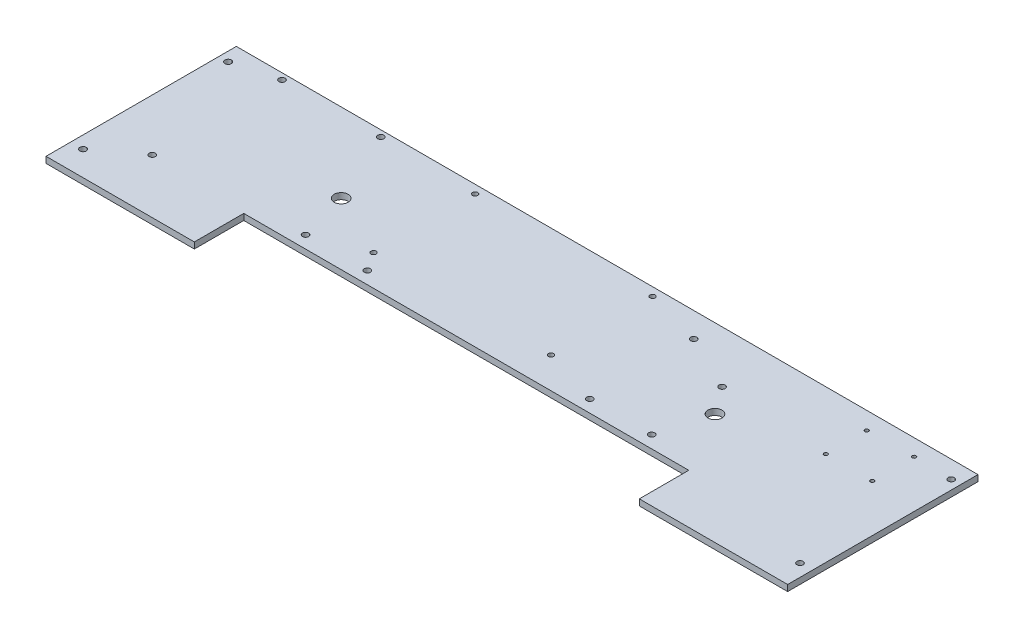
ISO-10303-21;
HEADER;
FILE_DESCRIPTION(('STEP AP214'),'2;1');
FILE_NAME('part.step','',(''),(''),'','','');
FILE_SCHEMA(('AUTOMOTIVE_DESIGN { 1 0 10303 214 1 1 1 1 }'));
ENDSEC;
DATA;
#1=APPLICATION_CONTEXT('core data for automotive mechanical design processes');
#2=APPLICATION_PROTOCOL_DEFINITION('international standard','automotive_design',2000,#1);
#3=PRODUCT_CONTEXT('',#1,'mechanical');
#4=PRODUCT('Part','Part','',(#3));
#5=PRODUCT_RELATED_PRODUCT_CATEGORY('part','',(#4));
#6=PRODUCT_DEFINITION_FORMATION('','',#4);
#7=PRODUCT_DEFINITION_CONTEXT('part definition',#1,'design');
#8=PRODUCT_DEFINITION('design','',#6,#7);
#9=PRODUCT_DEFINITION_SHAPE('','',#8);
#10=(LENGTH_UNIT() NAMED_UNIT(*) SI_UNIT(.MILLI.,.METRE.));
#11=(NAMED_UNIT(*) PLANE_ANGLE_UNIT() SI_UNIT($,.RADIAN.));
#12=(NAMED_UNIT(*) SI_UNIT($,.STERADIAN.) SOLID_ANGLE_UNIT());
#13=UNCERTAINTY_MEASURE_WITH_UNIT(LENGTH_MEASURE(1.E-05),#10,'distance_accuracy_value','');
#14=(GEOMETRIC_REPRESENTATION_CONTEXT(3) GLOBAL_UNCERTAINTY_ASSIGNED_CONTEXT((#13)) GLOBAL_UNIT_ASSIGNED_CONTEXT((#10,
#11,#12)) REPRESENTATION_CONTEXT('',''));
#15=CARTESIAN_POINT('',(0.,0.,0.));
#16=DIRECTION('',(0.,0.,1.));
#17=DIRECTION('',(1.,0.,0.));
#18=AXIS2_PLACEMENT_3D('',#15,#16,#17);
#19=CARTESIAN_POINT('',(609.6,6.35,50.8000000000004));
#20=DIRECTION('',(-1.,0.,0.));
#21=DIRECTION('',(0.,0.,1.));
#22=AXIS2_PLACEMENT_3D('',#19,#20,#21);
#23=PLANE('',#22);
#24=DIRECTION('',(0.,0.,-1.));
#25=VECTOR('',#24,1.);
#26=CARTESIAN_POINT('',(609.6,0.,50.8000000000004));
#27=LINE('',#26,#25);
#28=CARTESIAN_POINT('',(609.6,0.,50.8000000000004));
#29=VERTEX_POINT('',#28);
#30=CARTESIAN_POINT('',(609.6,0.,-144.78));
#31=VERTEX_POINT('',#30);
#32=EDGE_CURVE('E142',#29,#31,#27,.T.);
#33=ORIENTED_EDGE('',*,*,#32,.T.);
#34=DIRECTION('',(0.,-1.,0.));
#35=VECTOR('',#34,1.);
#36=CARTESIAN_POINT('',(609.6,6.35,-144.78));
#37=LINE('',#36,#35);
#38=CARTESIAN_POINT('',(609.6,6.35,-144.78));
#39=VERTEX_POINT('',#38);
#40=EDGE_CURVE('E12',#39,#31,#37,.T.);
#41=ORIENTED_EDGE('',*,*,#40,.F.);
#42=DIRECTION('',(0.,0.,-1.));
#43=VECTOR('',#42,1.);
#44=CARTESIAN_POINT('',(609.6,6.35,50.8000000000004));
#45=LINE('',#44,#43);
#46=CARTESIAN_POINT('',(609.6,6.35,50.8000000000004));
#47=VERTEX_POINT('',#46);
#48=EDGE_CURVE('E169',#47,#39,#45,.T.);
#49=ORIENTED_EDGE('',*,*,#48,.F.);
#50=DIRECTION('',(0.,-1.,0.));
#51=VECTOR('',#50,1.);
#52=CARTESIAN_POINT('',(609.6,6.35,50.8000000000004));
#53=LINE('',#52,#51);
#54=EDGE_CURVE('E138',#47,#29,#53,.T.);
#55=ORIENTED_EDGE('',*,*,#54,.T.);
#56=EDGE_LOOP('',(#33,#41,#49,#55));
#57=FACE_BOUND('',#56,.T.);
#58=ADVANCED_FACE('F39',(#57),#23,.F.);
#59=CARTESIAN_POINT('',(609.6,6.35,-144.78));
#60=DIRECTION('',(0.,0.,1.));
#61=DIRECTION('',(1.,0.,0.));
#62=AXIS2_PLACEMENT_3D('',#59,#60,#61);
#63=PLANE('',#62);
#64=DIRECTION('',(-1.,0.,0.));
#65=VECTOR('',#64,1.);
#66=CARTESIAN_POINT('',(609.6,0.,-144.78));
#67=LINE('',#66,#65);
#68=CARTESIAN_POINT('',(-152.4,0.,-144.78));
#69=VERTEX_POINT('',#68);
#70=EDGE_CURVE('E146',#31,#69,#67,.T.);
#71=ORIENTED_EDGE('',*,*,#70,.T.);
#72=DIRECTION('',(0.,-1.,0.));
#73=VECTOR('',#72,1.);
#74=CARTESIAN_POINT('',(-152.4,6.35,-144.78));
#75=LINE('',#74,#73);
#76=CARTESIAN_POINT('',(-152.4,6.35,-144.78));
#77=VERTEX_POINT('',#76);
#78=EDGE_CURVE('E49',#77,#69,#75,.T.);
#79=ORIENTED_EDGE('',*,*,#78,.F.);
#80=DIRECTION('',(-1.,0.,0.));
#81=VECTOR('',#80,1.);
#82=CARTESIAN_POINT('',(609.6,6.35,-144.78));
#83=LINE('',#82,#81);
#84=EDGE_CURVE('E101',#39,#77,#83,.T.);
#85=ORIENTED_EDGE('',*,*,#84,.F.);
#86=ORIENTED_EDGE('',*,*,#40,.T.);
#87=EDGE_LOOP('',(#71,#79,#85,#86));
#88=FACE_BOUND('',#87,.T.);
#89=ADVANCED_FACE('F397',(#88),#63,.F.);
#90=CARTESIAN_POINT('',(-152.4,6.35,50.7999999999999));
#91=DIRECTION('',(-1.,0.,0.));
#92=DIRECTION('',(0.,0.,1.));
#93=AXIS2_PLACEMENT_3D('',#90,#91,#92);
#94=PLANE('',#93);
#95=DIRECTION('',(0.,0.,-1.));
#96=VECTOR('',#95,1.);
#97=CARTESIAN_POINT('',(-152.4,0.,50.7999999999999));
#98=LINE('',#97,#96);
#99=CARTESIAN_POINT('',(-152.4,0.,50.7999999999999));
#100=VERTEX_POINT('',#99);
#101=EDGE_CURVE('E151',#100,#69,#98,.T.);
#102=ORIENTED_EDGE('',*,*,#101,.F.);
#103=DIRECTION('',(0.,-1.,0.));
#104=VECTOR('',#103,1.);
#105=CARTESIAN_POINT('',(-152.4,6.35,50.7999999999999));
#106=LINE('',#105,#104);
#107=CARTESIAN_POINT('',(-152.4,6.35,50.7999999999999));
#108=VERTEX_POINT('',#107);
#109=EDGE_CURVE('E179',#108,#100,#106,.T.);
#110=ORIENTED_EDGE('',*,*,#109,.F.);
#111=DIRECTION('',(0.,0.,-1.));
#112=VECTOR('',#111,1.);
#113=CARTESIAN_POINT('',(-152.4,6.35,50.7999999999999));
#114=LINE('',#113,#112);
#115=EDGE_CURVE('E367',#108,#77,#114,.T.);
#116=ORIENTED_EDGE('',*,*,#115,.T.);
#117=ORIENTED_EDGE('',*,*,#78,.T.);
#118=EDGE_LOOP('',(#102,#110,#116,#117));
#119=FACE_BOUND('',#118,.T.);
#120=ADVANCED_FACE('F401',(#119),#94,.T.);
#121=CARTESIAN_POINT('',(0.,6.35,50.8));
#122=DIRECTION('',(0.,0.,1.));
#123=DIRECTION('',(1.,0.,0.));
#124=AXIS2_PLACEMENT_3D('',#121,#122,#123);
#125=PLANE('',#124);
#126=DIRECTION('',(-1.,0.,0.));
#127=VECTOR('',#126,1.);
#128=CARTESIAN_POINT('',(0.,0.,50.8));
#129=LINE('',#128,#127);
#130=CARTESIAN_POINT('',(0.,0.,50.8));
#131=VERTEX_POINT('',#130);
#132=EDGE_CURVE('E155',#131,#100,#129,.T.);
#133=ORIENTED_EDGE('',*,*,#132,.F.);
#134=DIRECTION('',(0.,-1.,0.));
#135=VECTOR('',#134,1.);
#136=CARTESIAN_POINT('',(0.,6.35,50.8));
#137=LINE('',#136,#135);
#138=CARTESIAN_POINT('',(0.,6.35,50.8));
#139=VERTEX_POINT('',#138);
#140=EDGE_CURVE('E176',#139,#131,#137,.T.);
#141=ORIENTED_EDGE('',*,*,#140,.F.);
#142=DIRECTION('',(-1.,0.,0.));
#143=VECTOR('',#142,1.);
#144=CARTESIAN_POINT('',(0.,6.35,50.8));
#145=LINE('',#144,#143);
#146=EDGE_CURVE('E371',#139,#108,#145,.T.);
#147=ORIENTED_EDGE('',*,*,#146,.T.);
#148=ORIENTED_EDGE('',*,*,#109,.T.);
#149=EDGE_LOOP('',(#133,#141,#147,#148));
#150=FACE_BOUND('',#149,.T.);
#151=ADVANCED_FACE('F405',(#150),#125,.T.);
#152=CARTESIAN_POINT('',(0.,6.35,0.));
#153=DIRECTION('',(1.,0.,0.));
#154=DIRECTION('',(0.,0.,-1.));
#155=AXIS2_PLACEMENT_3D('',#152,#153,#154);
#156=PLANE('',#155);
#157=DIRECTION('',(0.,0.,1.));
#158=VECTOR('',#157,1.);
#159=CARTESIAN_POINT('',(0.,0.,0.));
#160=LINE('',#159,#158);
#161=CARTESIAN_POINT('',(0.,0.,0.));
#162=VERTEX_POINT('',#161);
#163=EDGE_CURVE('E159',#162,#131,#160,.T.);
#164=ORIENTED_EDGE('',*,*,#163,.F.);
#165=DIRECTION('',(0.,-1.,0.));
#166=VECTOR('',#165,1.);
#167=CARTESIAN_POINT('',(0.,6.35,0.));
#168=LINE('',#167,#166);
#169=CARTESIAN_POINT('',(0.,6.35,0.));
#170=VERTEX_POINT('',#169);
#171=EDGE_CURVE('E131',#170,#162,#168,.T.);
#172=ORIENTED_EDGE('',*,*,#171,.F.);
#173=DIRECTION('',(0.,0.,1.));
#174=VECTOR('',#173,1.);
#175=CARTESIAN_POINT('',(0.,6.35,0.));
#176=LINE('',#175,#174);
#177=EDGE_CURVE('E122',#170,#139,#176,.T.);
#178=ORIENTED_EDGE('',*,*,#177,.T.);
#179=ORIENTED_EDGE('',*,*,#140,.T.);
#180=EDGE_LOOP('',(#164,#172,#178,#179));
#181=FACE_BOUND('',#180,.T.);
#182=ADVANCED_FACE('F377',(#181),#156,.T.);
#183=CARTESIAN_POINT('',(0.,6.35,0.));
#184=DIRECTION('',(0.,0.,-1.));
#185=DIRECTION('',(-1.,0.,0.));
#186=AXIS2_PLACEMENT_3D('',#183,#184,#185);
#187=PLANE('',#186);
#188=DIRECTION('',(1.,0.,0.));
#189=VECTOR('',#188,1.);
#190=CARTESIAN_POINT('',(0.,0.,0.));
#191=LINE('',#190,#189);
#192=CARTESIAN_POINT('',(457.2,0.,1.2490009027033E-13));
#193=VERTEX_POINT('',#192);
#194=EDGE_CURVE('E129',#162,#193,#191,.T.);
#195=ORIENTED_EDGE('',*,*,#194,.T.);
#196=DIRECTION('',(0.,-1.,0.));
#197=VECTOR('',#196,1.);
#198=CARTESIAN_POINT('',(457.2,6.35,1.2490009027033E-13));
#199=LINE('',#198,#197);
#200=CARTESIAN_POINT('',(457.2,6.35,1.2490009027033E-13));
#201=VERTEX_POINT('',#200);
#202=EDGE_CURVE('E126',#201,#193,#199,.T.);
#203=ORIENTED_EDGE('',*,*,#202,.F.);
#204=DIRECTION('',(1.,0.,0.));
#205=VECTOR('',#204,1.);
#206=CARTESIAN_POINT('',(0.,6.35,0.));
#207=LINE('',#206,#205);
#208=EDGE_CURVE('E115',#170,#201,#207,.T.);
#209=ORIENTED_EDGE('',*,*,#208,.F.);
#210=ORIENTED_EDGE('',*,*,#171,.T.);
#211=EDGE_LOOP('',(#195,#203,#209,#210));
#212=FACE_BOUND('',#211,.T.);
#213=ADVANCED_FACE('F127',(#212),#187,.F.);
#214=CARTESIAN_POINT('',(457.2,6.35,1.2490009027033E-13));
#215=DIRECTION('',(1.,0.,0.));
#216=DIRECTION('',(0.,0.,-1.));
#217=AXIS2_PLACEMENT_3D('',#214,#215,#216);
#218=PLANE('',#217);
#219=DIRECTION('',(0.,0.,1.));
#220=VECTOR('',#219,1.);
#221=CARTESIAN_POINT('',(457.2,0.,1.2490009027033E-13));
#222=LINE('',#221,#220);
#223=CARTESIAN_POINT('',(457.2,0.,50.8000000000003));
#224=VERTEX_POINT('',#223);
#225=EDGE_CURVE('E87',#193,#224,#222,.T.);
#226=ORIENTED_EDGE('',*,*,#225,.T.);
#227=DIRECTION('',(0.,-1.,0.));
#228=VECTOR('',#227,1.);
#229=CARTESIAN_POINT('',(457.2,6.35,50.8000000000003));
#230=LINE('',#229,#228);
#231=CARTESIAN_POINT('',(457.2,6.35,50.8000000000003));
#232=VERTEX_POINT('',#231);
#233=EDGE_CURVE('E132',#232,#224,#230,.T.);
#234=ORIENTED_EDGE('',*,*,#233,.F.);
#235=DIRECTION('',(0.,0.,1.));
#236=VECTOR('',#235,1.);
#237=CARTESIAN_POINT('',(457.2,6.35,1.2490009027033E-13));
#238=LINE('',#237,#236);
#239=EDGE_CURVE('E119',#201,#232,#238,.T.);
#240=ORIENTED_EDGE('',*,*,#239,.F.);
#241=ORIENTED_EDGE('',*,*,#202,.T.);
#242=EDGE_LOOP('',(#226,#234,#240,#241));
#243=FACE_BOUND('',#242,.T.);
#244=ADVANCED_FACE('F134',(#243),#218,.F.);
#245=CARTESIAN_POINT('',(457.2,6.35,50.8000000000003));
#246=DIRECTION('',(0.,0.,-1.));
#247=DIRECTION('',(-1.,0.,0.));
#248=AXIS2_PLACEMENT_3D('',#245,#246,#247);
#249=PLANE('',#248);
#250=DIRECTION('',(1.,0.,0.));
#251=VECTOR('',#250,1.);
#252=CARTESIAN_POINT('',(457.2,0.,50.8000000000003));
#253=LINE('',#252,#251);
#254=EDGE_CURVE('E93',#224,#29,#253,.T.);
#255=ORIENTED_EDGE('',*,*,#254,.T.);
#256=ORIENTED_EDGE('',*,*,#54,.F.);
#257=DIRECTION('',(1.,0.,0.));
#258=VECTOR('',#257,1.);
#259=CARTESIAN_POINT('',(457.2,6.35,50.8000000000003));
#260=LINE('',#259,#258);
#261=EDGE_CURVE('E58',#232,#47,#260,.T.);
#262=ORIENTED_EDGE('',*,*,#261,.F.);
#263=ORIENTED_EDGE('',*,*,#233,.T.);
#264=EDGE_LOOP('',(#255,#256,#262,#263));
#265=FACE_BOUND('',#264,.T.);
#266=ADVANCED_FACE('F385',(#265),#249,.F.);
#267=CARTESIAN_POINT('',(0.,6.35,0.));
#268=DIRECTION('',(0.,1.,0.));
#269=DIRECTION('',(0.,0.,1.));
#270=AXIS2_PLACEMENT_3D('',#267,#268,#269);
#271=PLANE('',#270);
#272=CARTESIAN_POINT('',(406.4,6.35,-12.7));
#273=DIRECTION('',(0.,1.,0.));
#274=DIRECTION('',(0.,0.,1.));
#275=AXIS2_PLACEMENT_3D('',#272,#273,#274);
#276=CIRCLE('',#275,3.17499999999997);
#277=CARTESIAN_POINT('',(406.4,6.35,-9.52500000000003));
#278=VERTEX_POINT('',#277);
#279=EDGE_CURVE('E303',#278,#278,#276,.T.);
#280=ORIENTED_EDGE('',*,*,#279,.F.);
#281=EDGE_LOOP('',(#280));
#282=FACE_BOUND('',#281,.T.);
#283=CARTESIAN_POINT('',(342.9,6.35,-12.7));
#284=DIRECTION('',(0.,1.,0.));
#285=DIRECTION('',(0.,0.,1.));
#286=AXIS2_PLACEMENT_3D('',#283,#284,#285);
#287=CIRCLE('',#286,3.17499999999997);
#288=CARTESIAN_POINT('',(342.9,6.35,-9.52500000000002));
#289=VERTEX_POINT('',#288);
#290=EDGE_CURVE('E290',#289,#289,#287,.T.);
#291=ORIENTED_EDGE('',*,*,#290,.F.);
#292=EDGE_LOOP('',(#291));
#293=FACE_BOUND('',#292,.T.);
#294=CARTESIAN_POINT('',(400.05,6.35,-91.4399999999996));
#295=DIRECTION('',(0.,1.,0.));
#296=DIRECTION('',(0.,0.,1.));
#297=AXIS2_PLACEMENT_3D('',#294,#295,#296);
#298=CIRCLE('',#297,3.17499999999997);
#299=CARTESIAN_POINT('',(400.05,6.35,-88.2649999999997));
#300=VERTEX_POINT('',#299);
#301=EDGE_CURVE('E286',#300,#300,#298,.T.);
#302=ORIENTED_EDGE('',*,*,#301,.F.);
#303=EDGE_LOOP('',(#302));
#304=FACE_BOUND('',#303,.T.);
#305=CARTESIAN_POINT('',(283.8704,6.35,-31.7499999999996));
#306=DIRECTION('',(0.,1.,0.));
#307=DIRECTION('',(0.,0.,1.));
#308=AXIS2_PLACEMENT_3D('',#305,#306,#307);
#309=CIRCLE('',#308,2.66699999999997);
#310=CARTESIAN_POINT('',(283.8704,6.35,-29.0829999999997));
#311=VERTEX_POINT('',#310);
#312=EDGE_CURVE('E282',#311,#311,#309,.T.);
#313=ORIENTED_EDGE('',*,*,#312,.F.);
#314=EDGE_LOOP('',(#313));
#315=FACE_BOUND('',#314,.T.);
#316=CARTESIAN_POINT('',(342.9,6.35,-119.38));
#317=DIRECTION('',(0.,1.,0.));
#318=DIRECTION('',(0.,0.,1.));
#319=AXIS2_PLACEMENT_3D('',#316,#317,#318);
#320=CIRCLE('',#319,3.17499999999997);
#321=CARTESIAN_POINT('',(342.9,6.35,-116.205));
#322=VERTEX_POINT('',#321);
#323=EDGE_CURVE('E277',#322,#322,#320,.T.);
#324=ORIENTED_EDGE('',*,*,#323,.F.);
#325=EDGE_LOOP('',(#324));
#326=FACE_BOUND('',#325,.T.);
#327=CARTESIAN_POINT('',(283.8704,6.35,-136.144));
#328=DIRECTION('',(0.,1.,0.));
#329=DIRECTION('',(0.,0.,1.));
#330=AXIS2_PLACEMENT_3D('',#327,#328,#329);
#331=CIRCLE('',#330,2.66699999999997);
#332=CARTESIAN_POINT('',(283.8704,6.35,-133.477));
#333=VERTEX_POINT('',#332);
#334=EDGE_CURVE('E272',#333,#333,#331,.T.);
#335=ORIENTED_EDGE('',*,*,#334,.F.);
#336=EDGE_LOOP('',(#335));
#337=FACE_BOUND('',#336,.T.);
#338=CARTESIAN_POINT('',(101.6,6.35,-136.144));
#339=DIRECTION('',(0.,1.,0.));
#340=DIRECTION('',(0.,0.,1.));
#341=AXIS2_PLACEMENT_3D('',#338,#339,#340);
#342=CIRCLE('',#341,2.667);
#343=CARTESIAN_POINT('',(101.6,6.35,-133.477));
#344=VERTEX_POINT('',#343);
#345=EDGE_CURVE('E267',#344,#344,#342,.T.);
#346=ORIENTED_EDGE('',*,*,#345,.F.);
#347=EDGE_LOOP('',(#346));
#348=FACE_BOUND('',#347,.T.);
#349=CARTESIAN_POINT('',(114.3,6.35,-12.7));
#350=DIRECTION('',(0.,1.,0.));
#351=DIRECTION('',(0.,0.,1.));
#352=AXIS2_PLACEMENT_3D('',#349,#350,#351);
#353=CIRCLE('',#352,3.175);
#354=CARTESIAN_POINT('',(114.3,6.35,-9.52499999999999));
#355=VERTEX_POINT('',#354);
#356=EDGE_CURVE('E262',#355,#355,#353,.T.);
#357=ORIENTED_EDGE('',*,*,#356,.F.);
#358=EDGE_LOOP('',(#357));
#359=FACE_BOUND('',#358,.T.);
#360=CARTESIAN_POINT('',(101.6,6.35,-31.7499999999996));
#361=DIRECTION('',(0.,1.,0.));
#362=DIRECTION('',(0.,0.,1.));
#363=AXIS2_PLACEMENT_3D('',#360,#361,#362);
#364=CIRCLE('',#363,2.667);
#365=CARTESIAN_POINT('',(101.6,6.35,-29.0829999999996));
#366=VERTEX_POINT('',#365);
#367=EDGE_CURVE('E257',#366,#366,#364,.T.);
#368=ORIENTED_EDGE('',*,*,#367,.F.);
#369=EDGE_LOOP('',(#368));
#370=FACE_BOUND('',#369,.T.);
#371=CARTESIAN_POINT('',(50.8,6.35,-12.7));
#372=DIRECTION('',(0.,1.,0.));
#373=DIRECTION('',(0.,0.,1.));
#374=AXIS2_PLACEMENT_3D('',#371,#372,#373);
#375=CIRCLE('',#374,3.175);
#376=CARTESIAN_POINT('',(50.8,6.35,-9.52499999999999));
#377=VERTEX_POINT('',#376);
#378=EDGE_CURVE('E252',#377,#377,#375,.T.);
#379=ORIENTED_EDGE('',*,*,#378,.F.);
#380=EDGE_LOOP('',(#379));
#381=FACE_BOUND('',#380,.T.);
#382=CARTESIAN_POINT('',(420.624,6.35,-63.4999999999996));
#383=DIRECTION('',(0.,1.,0.));
#384=DIRECTION('',(0.,0.,1.));
#385=AXIS2_PLACEMENT_3D('',#382,#383,#384);
#386=CIRCLE('',#385,7.14375000000002);
#387=CARTESIAN_POINT('',(420.624,6.35,-56.3562499999996));
#388=VERTEX_POINT('',#387);
#389=EDGE_CURVE('E247',#388,#388,#386,.T.);
#390=ORIENTED_EDGE('',*,*,#389,.F.);
#391=EDGE_LOOP('',(#390));
#392=FACE_BOUND('',#391,.T.);
#393=CARTESIAN_POINT('',(513.207,6.35,-126.81712));
#394=DIRECTION('',(0.,1.,0.));
#395=DIRECTION('',(0.,0.,1.));
#396=AXIS2_PLACEMENT_3D('',#393,#394,#395);
#397=CIRCLE('',#396,1.90500000000005);
#398=CARTESIAN_POINT('',(513.207,6.35,-124.91212));
#399=VERTEX_POINT('',#398);
#400=EDGE_CURVE('E242',#399,#399,#397,.T.);
#401=ORIENTED_EDGE('',*,*,#400,.F.);
#402=EDGE_LOOP('',(#401));
#403=FACE_BOUND('',#402,.T.);
#404=CARTESIAN_POINT('',(560.959,6.35,-84.8105999999997));
#405=DIRECTION('',(0.,1.,0.));
#406=DIRECTION('',(0.,0.,1.));
#407=AXIS2_PLACEMENT_3D('',#404,#405,#406);
#408=CIRCLE('',#407,1.90500000000005);
#409=CARTESIAN_POINT('',(560.959,6.35,-82.9055999999997));
#410=VERTEX_POINT('',#409);
#411=EDGE_CURVE('E237',#410,#410,#408,.T.);
#412=ORIENTED_EDGE('',*,*,#411,.F.);
#413=EDGE_LOOP('',(#412));
#414=FACE_BOUND('',#413,.T.);
#415=CARTESIAN_POINT('',(513.207,6.35,-84.8105999999996));
#416=DIRECTION('',(0.,1.,0.));
#417=DIRECTION('',(0.,0.,1.));
#418=AXIS2_PLACEMENT_3D('',#415,#416,#417);
#419=CIRCLE('',#418,1.90500000000005);
#420=CARTESIAN_POINT('',(513.207,6.35,-82.9055999999996));
#421=VERTEX_POINT('',#420);
#422=EDGE_CURVE('E232',#421,#421,#419,.T.);
#423=ORIENTED_EDGE('',*,*,#422,.F.);
#424=EDGE_LOOP('',(#423));
#425=FACE_BOUND('',#424,.T.);
#426=CARTESIAN_POINT('',(560.959,6.35,-127.8636));
#427=DIRECTION('',(0.,1.,0.));
#428=DIRECTION('',(0.,0.,1.));
#429=AXIS2_PLACEMENT_3D('',#426,#427,#428);
#430=CIRCLE('',#429,1.90500000000005);
#431=CARTESIAN_POINT('',(560.959,6.35,-125.9586));
#432=VERTEX_POINT('',#431);
#433=EDGE_CURVE('E227',#432,#432,#430,.T.);
#434=ORIENTED_EDGE('',*,*,#433,.F.);
#435=EDGE_LOOP('',(#434));
#436=FACE_BOUND('',#435,.T.);
#437=CARTESIAN_POINT('',(596.9,6.35,25.4000000000003));
#438=DIRECTION('',(0.,1.,0.));
#439=DIRECTION('',(0.,0.,1.));
#440=AXIS2_PLACEMENT_3D('',#437,#438,#439);
#441=CIRCLE('',#440,3.17500000000008);
#442=CARTESIAN_POINT('',(596.9,6.35,28.5750000000003));
#443=VERTEX_POINT('',#442);
#444=EDGE_CURVE('E222',#443,#443,#441,.T.);
#445=ORIENTED_EDGE('',*,*,#444,.F.);
#446=EDGE_LOOP('',(#445));
#447=FACE_BOUND('',#446,.T.);
#448=CARTESIAN_POINT('',(600.075,6.35,-126.81712));
#449=DIRECTION('',(0.,1.,0.));
#450=DIRECTION('',(0.,0.,1.));
#451=AXIS2_PLACEMENT_3D('',#448,#449,#450);
#452=CIRCLE('',#451,3.17500000000009);
#453=CARTESIAN_POINT('',(600.075,6.35,-123.64212));
#454=VERTEX_POINT('',#453);
#455=EDGE_CURVE('E217',#454,#454,#452,.T.);
#456=ORIENTED_EDGE('',*,*,#455,.F.);
#457=EDGE_LOOP('',(#456));
#458=FACE_BOUND('',#457,.T.);
#459=CARTESIAN_POINT('',(36.576,6.35,-63.5));
#460=DIRECTION('',(0.,1.,0.));
#461=DIRECTION('',(0.,0.,1.));
#462=AXIS2_PLACEMENT_3D('',#459,#460,#461);
#463=CIRCLE('',#462,7.14375);
#464=CARTESIAN_POINT('',(36.576,6.35,-56.35625));
#465=VERTEX_POINT('',#464);
#466=EDGE_CURVE('E212',#465,#465,#463,.T.);
#467=ORIENTED_EDGE('',*,*,#466,.F.);
#468=EDGE_LOOP('',(#467));
#469=FACE_BOUND('',#468,.T.);
#470=CARTESIAN_POINT('',(2.41299999999994,6.35,-138.379200000001));
#471=DIRECTION('',(0.,1.,0.));
#472=DIRECTION('',(0.,0.,1.));
#473=AXIS2_PLACEMENT_3D('',#470,#471,#472);
#474=CIRCLE('',#473,3.175);
#475=CARTESIAN_POINT('',(2.41299999999994,6.35,-135.204200000001));
#476=VERTEX_POINT('',#475);
#477=EDGE_CURVE('E207',#476,#476,#474,.T.);
#478=ORIENTED_EDGE('',*,*,#477,.F.);
#479=EDGE_LOOP('',(#478));
#480=FACE_BOUND('',#479,.T.);
#481=CARTESIAN_POINT('',(-99.1108000000001,6.35,-138.3792));
#482=DIRECTION('',(0.,1.,0.));
#483=DIRECTION('',(0.,0.,1.));
#484=AXIS2_PLACEMENT_3D('',#481,#482,#483);
#485=CIRCLE('',#484,3.175);
#486=CARTESIAN_POINT('',(-99.1108000000001,6.35,-135.2042));
#487=VERTEX_POINT('',#486);
#488=EDGE_CURVE('E202',#487,#487,#485,.T.);
#489=ORIENTED_EDGE('',*,*,#488,.F.);
#490=EDGE_LOOP('',(#489));
#491=FACE_BOUND('',#490,.T.);
#492=CARTESIAN_POINT('',(-142.875,6.35,-126.81712));
#493=DIRECTION('',(0.,1.,0.));
#494=DIRECTION('',(0.,0.,1.));
#495=AXIS2_PLACEMENT_3D('',#492,#493,#494);
#496=CIRCLE('',#495,3.30200000000001);
#497=CARTESIAN_POINT('',(-142.875,6.35,-123.51512));
#498=VERTEX_POINT('',#497);
#499=EDGE_CURVE('E197',#498,#498,#496,.T.);
#500=ORIENTED_EDGE('',*,*,#499,.F.);
#501=EDGE_LOOP('',(#500));
#502=FACE_BOUND('',#501,.T.);
#503=CARTESIAN_POINT('',(-99.1108,6.35,-5.02919999999996));
#504=DIRECTION('',(0.,1.,0.));
#505=DIRECTION('',(0.,0.,1.));
#506=AXIS2_PLACEMENT_3D('',#503,#504,#505);
#507=CIRCLE('',#506,3.175);
#508=CARTESIAN_POINT('',(-99.1108,6.35,-1.85419999999996));
#509=VERTEX_POINT('',#508);
#510=EDGE_CURVE('E192',#509,#509,#507,.T.);
#511=ORIENTED_EDGE('',*,*,#510,.F.);
#512=EDGE_LOOP('',(#511));
#513=FACE_BOUND('',#512,.T.);
#514=CARTESIAN_POINT('',(-139.7,6.35,25.4));
#515=DIRECTION('',(0.,1.,0.));
#516=DIRECTION('',(0.,0.,1.));
#517=AXIS2_PLACEMENT_3D('',#514,#515,#516);
#518=CIRCLE('',#517,3.30200000000001);
#519=CARTESIAN_POINT('',(-139.7,6.35,28.7020000000001));
#520=VERTEX_POINT('',#519);
#521=EDGE_CURVE('E187',#520,#520,#518,.T.);
#522=ORIENTED_EDGE('',*,*,#521,.F.);
#523=EDGE_LOOP('',(#522));
#524=FACE_BOUND('',#523,.T.);
#525=ORIENTED_EDGE('',*,*,#48,.T.);
#526=ORIENTED_EDGE('',*,*,#84,.T.);
#527=ORIENTED_EDGE('',*,*,#115,.F.);
#528=ORIENTED_EDGE('',*,*,#146,.F.);
#529=ORIENTED_EDGE('',*,*,#177,.F.);
#530=ORIENTED_EDGE('',*,*,#208,.T.);
#531=ORIENTED_EDGE('',*,*,#239,.T.);
#532=ORIENTED_EDGE('',*,*,#261,.T.);
#533=EDGE_LOOP('',(#525,#526,#527,#528,#529,#530,#531,#532));
#534=FACE_BOUND('',#533,.T.);
#535=ADVANCED_FACE('F117',(#282,#293,#304,#315,#326,#337,#348,#359,#370,#381,#392,#403,#414,
#425,#436,#447,#458,#469,#480,#491,#502,#513,#524,#534),#271,.T.);
#536=CARTESIAN_POINT('',(0.,0.,0.));
#537=DIRECTION('',(0.,1.,0.));
#538=DIRECTION('',(0.,0.,1.));
#539=AXIS2_PLACEMENT_3D('',#536,#537,#538);
#540=PLANE('',#539);
#541=CARTESIAN_POINT('',(406.4,0.,-12.7));
#542=DIRECTION('',(0.,1.,0.));
#543=DIRECTION('',(0.,0.,1.));
#544=AXIS2_PLACEMENT_3D('',#541,#542,#543);
#545=CIRCLE('',#544,3.17499999999997);
#546=CARTESIAN_POINT('',(406.4,0.,-9.52500000000003));
#547=VERTEX_POINT('',#546);
#548=EDGE_CURVE('E42',#547,#547,#545,.T.);
#549=ORIENTED_EDGE('',*,*,#548,.T.);
#550=EDGE_LOOP('',(#549));
#551=FACE_BOUND('',#550,.T.);
#552=CARTESIAN_POINT('',(342.9,0.,-12.7));
#553=DIRECTION('',(0.,1.,0.));
#554=DIRECTION('',(0.,0.,1.));
#555=AXIS2_PLACEMENT_3D('',#552,#553,#554);
#556=CIRCLE('',#555,3.17499999999997);
#557=CARTESIAN_POINT('',(342.9,0.,-9.52500000000002));
#558=VERTEX_POINT('',#557);
#559=EDGE_CURVE('E287',#558,#558,#556,.T.);
#560=ORIENTED_EDGE('',*,*,#559,.T.);
#561=EDGE_LOOP('',(#560));
#562=FACE_BOUND('',#561,.T.);
#563=CARTESIAN_POINT('',(400.05,0.,-91.4399999999996));
#564=DIRECTION('',(0.,1.,0.));
#565=DIRECTION('',(0.,0.,1.));
#566=AXIS2_PLACEMENT_3D('',#563,#564,#565);
#567=CIRCLE('',#566,3.17499999999997);
#568=CARTESIAN_POINT('',(400.05,0.,-88.2649999999997));
#569=VERTEX_POINT('',#568);
#570=EDGE_CURVE('E283',#569,#569,#567,.T.);
#571=ORIENTED_EDGE('',*,*,#570,.T.);
#572=EDGE_LOOP('',(#571));
#573=FACE_BOUND('',#572,.T.);
#574=CARTESIAN_POINT('',(283.8704,0.,-31.7499999999996));
#575=DIRECTION('',(0.,1.,0.));
#576=DIRECTION('',(0.,0.,1.));
#577=AXIS2_PLACEMENT_3D('',#574,#575,#576);
#578=CIRCLE('',#577,2.66699999999997);
#579=CARTESIAN_POINT('',(283.8704,0.,-29.0829999999997));
#580=VERTEX_POINT('',#579);
#581=EDGE_CURVE('E278',#580,#580,#578,.T.);
#582=ORIENTED_EDGE('',*,*,#581,.T.);
#583=EDGE_LOOP('',(#582));
#584=FACE_BOUND('',#583,.T.);
#585=CARTESIAN_POINT('',(342.9,0.,-119.38));
#586=DIRECTION('',(0.,1.,0.));
#587=DIRECTION('',(0.,0.,1.));
#588=AXIS2_PLACEMENT_3D('',#585,#586,#587);
#589=CIRCLE('',#588,3.17499999999997);
#590=CARTESIAN_POINT('',(342.9,0.,-116.205));
#591=VERTEX_POINT('',#590);
#592=EDGE_CURVE('E273',#591,#591,#589,.T.);
#593=ORIENTED_EDGE('',*,*,#592,.T.);
#594=EDGE_LOOP('',(#593));
#595=FACE_BOUND('',#594,.T.);
#596=CARTESIAN_POINT('',(283.8704,0.,-136.144));
#597=DIRECTION('',(0.,1.,0.));
#598=DIRECTION('',(0.,0.,1.));
#599=AXIS2_PLACEMENT_3D('',#596,#597,#598);
#600=CIRCLE('',#599,2.66699999999997);
#601=CARTESIAN_POINT('',(283.8704,0.,-133.477));
#602=VERTEX_POINT('',#601);
#603=EDGE_CURVE('E268',#602,#602,#600,.T.);
#604=ORIENTED_EDGE('',*,*,#603,.T.);
#605=EDGE_LOOP('',(#604));
#606=FACE_BOUND('',#605,.T.);
#607=CARTESIAN_POINT('',(101.6,0.,-136.144));
#608=DIRECTION('',(0.,1.,0.));
#609=DIRECTION('',(0.,0.,1.));
#610=AXIS2_PLACEMENT_3D('',#607,#608,#609);
#611=CIRCLE('',#610,2.667);
#612=CARTESIAN_POINT('',(101.6,0.,-133.477));
#613=VERTEX_POINT('',#612);
#614=EDGE_CURVE('E263',#613,#613,#611,.T.);
#615=ORIENTED_EDGE('',*,*,#614,.T.);
#616=EDGE_LOOP('',(#615));
#617=FACE_BOUND('',#616,.T.);
#618=CARTESIAN_POINT('',(114.3,0.,-12.7));
#619=DIRECTION('',(0.,1.,0.));
#620=DIRECTION('',(0.,0.,1.));
#621=AXIS2_PLACEMENT_3D('',#618,#619,#620);
#622=CIRCLE('',#621,3.175);
#623=CARTESIAN_POINT('',(114.3,0.,-9.52499999999999));
#624=VERTEX_POINT('',#623);
#625=EDGE_CURVE('E258',#624,#624,#622,.T.);
#626=ORIENTED_EDGE('',*,*,#625,.T.);
#627=EDGE_LOOP('',(#626));
#628=FACE_BOUND('',#627,.T.);
#629=CARTESIAN_POINT('',(101.6,0.,-31.7499999999996));
#630=DIRECTION('',(0.,1.,0.));
#631=DIRECTION('',(0.,0.,1.));
#632=AXIS2_PLACEMENT_3D('',#629,#630,#631);
#633=CIRCLE('',#632,2.667);
#634=CARTESIAN_POINT('',(101.6,0.,-29.0829999999996));
#635=VERTEX_POINT('',#634);
#636=EDGE_CURVE('E253',#635,#635,#633,.T.);
#637=ORIENTED_EDGE('',*,*,#636,.T.);
#638=EDGE_LOOP('',(#637));
#639=FACE_BOUND('',#638,.T.);
#640=CARTESIAN_POINT('',(50.8,0.,-12.7));
#641=DIRECTION('',(0.,1.,0.));
#642=DIRECTION('',(0.,0.,1.));
#643=AXIS2_PLACEMENT_3D('',#640,#641,#642);
#644=CIRCLE('',#643,3.175);
#645=CARTESIAN_POINT('',(50.8,0.,-9.52499999999999));
#646=VERTEX_POINT('',#645);
#647=EDGE_CURVE('E248',#646,#646,#644,.T.);
#648=ORIENTED_EDGE('',*,*,#647,.T.);
#649=EDGE_LOOP('',(#648));
#650=FACE_BOUND('',#649,.T.);
#651=CARTESIAN_POINT('',(420.624,0.,-63.4999999999996));
#652=DIRECTION('',(0.,1.,0.));
#653=DIRECTION('',(0.,0.,1.));
#654=AXIS2_PLACEMENT_3D('',#651,#652,#653);
#655=CIRCLE('',#654,7.14375000000002);
#656=CARTESIAN_POINT('',(420.624,0.,-56.3562499999996));
#657=VERTEX_POINT('',#656);
#658=EDGE_CURVE('E243',#657,#657,#655,.T.);
#659=ORIENTED_EDGE('',*,*,#658,.T.);
#660=EDGE_LOOP('',(#659));
#661=FACE_BOUND('',#660,.T.);
#662=CARTESIAN_POINT('',(513.207,0.,-126.81712));
#663=DIRECTION('',(0.,1.,0.));
#664=DIRECTION('',(0.,0.,1.));
#665=AXIS2_PLACEMENT_3D('',#662,#663,#664);
#666=CIRCLE('',#665,1.90500000000005);
#667=CARTESIAN_POINT('',(513.207,0.,-124.91212));
#668=VERTEX_POINT('',#667);
#669=EDGE_CURVE('E238',#668,#668,#666,.T.);
#670=ORIENTED_EDGE('',*,*,#669,.T.);
#671=EDGE_LOOP('',(#670));
#672=FACE_BOUND('',#671,.T.);
#673=CARTESIAN_POINT('',(560.959,0.,-84.8105999999997));
#674=DIRECTION('',(0.,1.,0.));
#675=DIRECTION('',(0.,0.,1.));
#676=AXIS2_PLACEMENT_3D('',#673,#674,#675);
#677=CIRCLE('',#676,1.90500000000005);
#678=CARTESIAN_POINT('',(560.959,0.,-82.9055999999997));
#679=VERTEX_POINT('',#678);
#680=EDGE_CURVE('E233',#679,#679,#677,.T.);
#681=ORIENTED_EDGE('',*,*,#680,.T.);
#682=EDGE_LOOP('',(#681));
#683=FACE_BOUND('',#682,.T.);
#684=CARTESIAN_POINT('',(513.207,0.,-84.8105999999996));
#685=DIRECTION('',(0.,1.,0.));
#686=DIRECTION('',(0.,0.,1.));
#687=AXIS2_PLACEMENT_3D('',#684,#685,#686);
#688=CIRCLE('',#687,1.90500000000005);
#689=CARTESIAN_POINT('',(513.207,0.,-82.9055999999996));
#690=VERTEX_POINT('',#689);
#691=EDGE_CURVE('E228',#690,#690,#688,.T.);
#692=ORIENTED_EDGE('',*,*,#691,.T.);
#693=EDGE_LOOP('',(#692));
#694=FACE_BOUND('',#693,.T.);
#695=CARTESIAN_POINT('',(560.959,0.,-127.8636));
#696=DIRECTION('',(0.,1.,0.));
#697=DIRECTION('',(0.,0.,1.));
#698=AXIS2_PLACEMENT_3D('',#695,#696,#697);
#699=CIRCLE('',#698,1.90500000000005);
#700=CARTESIAN_POINT('',(560.959,0.,-125.9586));
#701=VERTEX_POINT('',#700);
#702=EDGE_CURVE('E223',#701,#701,#699,.T.);
#703=ORIENTED_EDGE('',*,*,#702,.T.);
#704=EDGE_LOOP('',(#703));
#705=FACE_BOUND('',#704,.T.);
#706=CARTESIAN_POINT('',(596.9,0.,25.4000000000003));
#707=DIRECTION('',(0.,1.,0.));
#708=DIRECTION('',(0.,0.,1.));
#709=AXIS2_PLACEMENT_3D('',#706,#707,#708);
#710=CIRCLE('',#709,3.17500000000008);
#711=CARTESIAN_POINT('',(596.9,0.,28.5750000000003));
#712=VERTEX_POINT('',#711);
#713=EDGE_CURVE('E218',#712,#712,#710,.T.);
#714=ORIENTED_EDGE('',*,*,#713,.T.);
#715=EDGE_LOOP('',(#714));
#716=FACE_BOUND('',#715,.T.);
#717=CARTESIAN_POINT('',(600.075,0.,-126.81712));
#718=DIRECTION('',(0.,1.,0.));
#719=DIRECTION('',(0.,0.,1.));
#720=AXIS2_PLACEMENT_3D('',#717,#718,#719);
#721=CIRCLE('',#720,3.17500000000009);
#722=CARTESIAN_POINT('',(600.075,0.,-123.64212));
#723=VERTEX_POINT('',#722);
#724=EDGE_CURVE('E213',#723,#723,#721,.T.);
#725=ORIENTED_EDGE('',*,*,#724,.T.);
#726=EDGE_LOOP('',(#725));
#727=FACE_BOUND('',#726,.T.);
#728=CARTESIAN_POINT('',(36.576,0.,-63.5));
#729=DIRECTION('',(0.,1.,0.));
#730=DIRECTION('',(0.,0.,1.));
#731=AXIS2_PLACEMENT_3D('',#728,#729,#730);
#732=CIRCLE('',#731,7.14375);
#733=CARTESIAN_POINT('',(36.576,0.,-56.35625));
#734=VERTEX_POINT('',#733);
#735=EDGE_CURVE('E208',#734,#734,#732,.T.);
#736=ORIENTED_EDGE('',*,*,#735,.T.);
#737=EDGE_LOOP('',(#736));
#738=FACE_BOUND('',#737,.T.);
#739=CARTESIAN_POINT('',(2.41299999999994,0.,-138.379200000001));
#740=DIRECTION('',(0.,1.,0.));
#741=DIRECTION('',(0.,0.,1.));
#742=AXIS2_PLACEMENT_3D('',#739,#740,#741);
#743=CIRCLE('',#742,3.175);
#744=CARTESIAN_POINT('',(2.41299999999994,0.,-135.204200000001));
#745=VERTEX_POINT('',#744);
#746=EDGE_CURVE('E203',#745,#745,#743,.T.);
#747=ORIENTED_EDGE('',*,*,#746,.T.);
#748=EDGE_LOOP('',(#747));
#749=FACE_BOUND('',#748,.T.);
#750=CARTESIAN_POINT('',(-99.1108000000001,0.,-138.3792));
#751=DIRECTION('',(0.,1.,0.));
#752=DIRECTION('',(0.,0.,1.));
#753=AXIS2_PLACEMENT_3D('',#750,#751,#752);
#754=CIRCLE('',#753,3.175);
#755=CARTESIAN_POINT('',(-99.1108000000001,0.,-135.2042));
#756=VERTEX_POINT('',#755);
#757=EDGE_CURVE('E198',#756,#756,#754,.T.);
#758=ORIENTED_EDGE('',*,*,#757,.T.);
#759=EDGE_LOOP('',(#758));
#760=FACE_BOUND('',#759,.T.);
#761=CARTESIAN_POINT('',(-142.875,0.,-126.81712));
#762=DIRECTION('',(0.,1.,0.));
#763=DIRECTION('',(0.,0.,1.));
#764=AXIS2_PLACEMENT_3D('',#761,#762,#763);
#765=CIRCLE('',#764,3.30200000000001);
#766=CARTESIAN_POINT('',(-142.875,0.,-123.51512));
#767=VERTEX_POINT('',#766);
#768=EDGE_CURVE('E193',#767,#767,#765,.T.);
#769=ORIENTED_EDGE('',*,*,#768,.T.);
#770=EDGE_LOOP('',(#769));
#771=FACE_BOUND('',#770,.T.);
#772=CARTESIAN_POINT('',(-99.1108,0.,-5.02919999999996));
#773=DIRECTION('',(0.,1.,0.));
#774=DIRECTION('',(0.,0.,1.));
#775=AXIS2_PLACEMENT_3D('',#772,#773,#774);
#776=CIRCLE('',#775,3.175);
#777=CARTESIAN_POINT('',(-99.1108,0.,-1.85419999999996));
#778=VERTEX_POINT('',#777);
#779=EDGE_CURVE('E188',#778,#778,#776,.T.);
#780=ORIENTED_EDGE('',*,*,#779,.T.);
#781=EDGE_LOOP('',(#780));
#782=FACE_BOUND('',#781,.T.);
#783=CARTESIAN_POINT('',(-139.7,0.,25.4));
#784=DIRECTION('',(0.,1.,0.));
#785=DIRECTION('',(0.,0.,1.));
#786=AXIS2_PLACEMENT_3D('',#783,#784,#785);
#787=CIRCLE('',#786,3.30200000000001);
#788=CARTESIAN_POINT('',(-139.7,0.,28.7020000000001));
#789=VERTEX_POINT('',#788);
#790=EDGE_CURVE('E147',#789,#789,#787,.T.);
#791=ORIENTED_EDGE('',*,*,#790,.T.);
#792=EDGE_LOOP('',(#791));
#793=FACE_BOUND('',#792,.T.);
#794=ORIENTED_EDGE('',*,*,#32,.F.);
#795=ORIENTED_EDGE('',*,*,#254,.F.);
#796=ORIENTED_EDGE('',*,*,#225,.F.);
#797=ORIENTED_EDGE('',*,*,#194,.F.);
#798=ORIENTED_EDGE('',*,*,#163,.T.);
#799=ORIENTED_EDGE('',*,*,#132,.T.);
#800=ORIENTED_EDGE('',*,*,#101,.T.);
#801=ORIENTED_EDGE('',*,*,#70,.F.);
#802=EDGE_LOOP('',(#794,#795,#796,#797,#798,#799,#800,#801));
#803=FACE_BOUND('',#802,.T.);
#804=ADVANCED_FACE('F381',(#551,#562,#573,#584,#595,#606,#617,#628,#639,#650,#661,#672,#683,
#694,#705,#716,#727,#738,#749,#760,#771,#782,#793,#803),#540,.F.);
#805=CARTESIAN_POINT('',(-139.7,-1.27,25.4));
#806=DIRECTION('',(0.,1.,0.));
#807=DIRECTION('',(0.,0.,1.));
#808=AXIS2_PLACEMENT_3D('',#805,#806,#807);
#809=CYLINDRICAL_SURFACE('',#808,3.30200000000001);
#810=ORIENTED_EDGE('',*,*,#521,.T.);
#811=EDGE_LOOP('',(#810));
#812=FACE_BOUND('',#811,.T.);
#813=ORIENTED_EDGE('',*,*,#790,.F.);
#814=EDGE_LOOP('',(#813));
#815=FACE_BOUND('',#814,.T.);
#816=ADVANCED_FACE('F433',(#812,#815),#809,.F.);
#817=CARTESIAN_POINT('',(-99.1108,-1.27,-5.02919999999996));
#818=DIRECTION('',(0.,1.,0.));
#819=DIRECTION('',(0.,0.,1.));
#820=AXIS2_PLACEMENT_3D('',#817,#818,#819);
#821=CYLINDRICAL_SURFACE('',#820,3.175);
#822=ORIENTED_EDGE('',*,*,#510,.T.);
#823=EDGE_LOOP('',(#822));
#824=FACE_BOUND('',#823,.T.);
#825=ORIENTED_EDGE('',*,*,#779,.F.);
#826=EDGE_LOOP('',(#825));
#827=FACE_BOUND('',#826,.T.);
#828=ADVANCED_FACE('F438',(#824,#827),#821,.F.);
#829=CARTESIAN_POINT('',(-142.875,-1.27,-126.81712));
#830=DIRECTION('',(0.,1.,0.));
#831=DIRECTION('',(0.,0.,1.));
#832=AXIS2_PLACEMENT_3D('',#829,#830,#831);
#833=CYLINDRICAL_SURFACE('',#832,3.30200000000001);
#834=ORIENTED_EDGE('',*,*,#499,.T.);
#835=EDGE_LOOP('',(#834));
#836=FACE_BOUND('',#835,.T.);
#837=ORIENTED_EDGE('',*,*,#768,.F.);
#838=EDGE_LOOP('',(#837));
#839=FACE_BOUND('',#838,.T.);
#840=ADVANCED_FACE('F450',(#836,#839),#833,.F.);
#841=CARTESIAN_POINT('',(-99.1108000000001,-1.27,-138.3792));
#842=DIRECTION('',(0.,1.,0.));
#843=DIRECTION('',(0.,0.,1.));
#844=AXIS2_PLACEMENT_3D('',#841,#842,#843);
#845=CYLINDRICAL_SURFACE('',#844,3.175);
#846=ORIENTED_EDGE('',*,*,#488,.T.);
#847=EDGE_LOOP('',(#846));
#848=FACE_BOUND('',#847,.T.);
#849=ORIENTED_EDGE('',*,*,#757,.F.);
#850=EDGE_LOOP('',(#849));
#851=FACE_BOUND('',#850,.T.);
#852=ADVANCED_FACE('F460',(#848,#851),#845,.F.);
#853=CARTESIAN_POINT('',(2.41299999999994,-1.27,-138.379200000001));
#854=DIRECTION('',(0.,1.,0.));
#855=DIRECTION('',(0.,0.,1.));
#856=AXIS2_PLACEMENT_3D('',#853,#854,#855);
#857=CYLINDRICAL_SURFACE('',#856,3.175);
#858=ORIENTED_EDGE('',*,*,#477,.T.);
#859=EDGE_LOOP('',(#858));
#860=FACE_BOUND('',#859,.T.);
#861=ORIENTED_EDGE('',*,*,#746,.F.);
#862=EDGE_LOOP('',(#861));
#863=FACE_BOUND('',#862,.T.);
#864=ADVANCED_FACE('F470',(#860,#863),#857,.F.);
#865=CARTESIAN_POINT('',(36.576,-1.27,-63.5));
#866=DIRECTION('',(0.,1.,0.));
#867=DIRECTION('',(0.,0.,1.));
#868=AXIS2_PLACEMENT_3D('',#865,#866,#867);
#869=CYLINDRICAL_SURFACE('',#868,7.14375);
#870=ORIENTED_EDGE('',*,*,#466,.T.);
#871=EDGE_LOOP('',(#870));
#872=FACE_BOUND('',#871,.T.);
#873=ORIENTED_EDGE('',*,*,#735,.F.);
#874=EDGE_LOOP('',(#873));
#875=FACE_BOUND('',#874,.T.);
#876=ADVANCED_FACE('F480',(#872,#875),#869,.F.);
#877=CARTESIAN_POINT('',(600.075,-1.27,-126.81712));
#878=DIRECTION('',(0.,1.,0.));
#879=DIRECTION('',(0.,0.,1.));
#880=AXIS2_PLACEMENT_3D('',#877,#878,#879);
#881=CYLINDRICAL_SURFACE('',#880,3.17500000000009);
#882=ORIENTED_EDGE('',*,*,#455,.T.);
#883=EDGE_LOOP('',(#882));
#884=FACE_BOUND('',#883,.T.);
#885=ORIENTED_EDGE('',*,*,#724,.F.);
#886=EDGE_LOOP('',(#885));
#887=FACE_BOUND('',#886,.T.);
#888=ADVANCED_FACE('F490',(#884,#887),#881,.F.);
#889=CARTESIAN_POINT('',(596.9,-1.27,25.4000000000003));
#890=DIRECTION('',(0.,1.,0.));
#891=DIRECTION('',(0.,0.,1.));
#892=AXIS2_PLACEMENT_3D('',#889,#890,#891);
#893=CYLINDRICAL_SURFACE('',#892,3.17500000000008);
#894=ORIENTED_EDGE('',*,*,#444,.T.);
#895=EDGE_LOOP('',(#894));
#896=FACE_BOUND('',#895,.T.);
#897=ORIENTED_EDGE('',*,*,#713,.F.);
#898=EDGE_LOOP('',(#897));
#899=FACE_BOUND('',#898,.T.);
#900=ADVANCED_FACE('F500',(#896,#899),#893,.F.);
#901=CARTESIAN_POINT('',(560.959,-1.27,-127.8636));
#902=DIRECTION('',(0.,1.,0.));
#903=DIRECTION('',(0.,0.,1.));
#904=AXIS2_PLACEMENT_3D('',#901,#902,#903);
#905=CYLINDRICAL_SURFACE('',#904,1.90500000000005);
#906=ORIENTED_EDGE('',*,*,#433,.T.);
#907=EDGE_LOOP('',(#906));
#908=FACE_BOUND('',#907,.T.);
#909=ORIENTED_EDGE('',*,*,#702,.F.);
#910=EDGE_LOOP('',(#909));
#911=FACE_BOUND('',#910,.T.);
#912=ADVANCED_FACE('F510',(#908,#911),#905,.F.);
#913=CARTESIAN_POINT('',(513.207,-1.27,-84.8105999999996));
#914=DIRECTION('',(0.,1.,0.));
#915=DIRECTION('',(0.,0.,1.));
#916=AXIS2_PLACEMENT_3D('',#913,#914,#915);
#917=CYLINDRICAL_SURFACE('',#916,1.90500000000005);
#918=ORIENTED_EDGE('',*,*,#422,.T.);
#919=EDGE_LOOP('',(#918));
#920=FACE_BOUND('',#919,.T.);
#921=ORIENTED_EDGE('',*,*,#691,.F.);
#922=EDGE_LOOP('',(#921));
#923=FACE_BOUND('',#922,.T.);
#924=ADVANCED_FACE('F520',(#920,#923),#917,.F.);
#925=CARTESIAN_POINT('',(560.959,-1.27,-84.8105999999997));
#926=DIRECTION('',(0.,1.,0.));
#927=DIRECTION('',(0.,0.,1.));
#928=AXIS2_PLACEMENT_3D('',#925,#926,#927);
#929=CYLINDRICAL_SURFACE('',#928,1.90500000000005);
#930=ORIENTED_EDGE('',*,*,#411,.T.);
#931=EDGE_LOOP('',(#930));
#932=FACE_BOUND('',#931,.T.);
#933=ORIENTED_EDGE('',*,*,#680,.F.);
#934=EDGE_LOOP('',(#933));
#935=FACE_BOUND('',#934,.T.);
#936=ADVANCED_FACE('F530',(#932,#935),#929,.F.);
#937=CARTESIAN_POINT('',(513.207,-1.27,-126.81712));
#938=DIRECTION('',(0.,1.,0.));
#939=DIRECTION('',(0.,0.,1.));
#940=AXIS2_PLACEMENT_3D('',#937,#938,#939);
#941=CYLINDRICAL_SURFACE('',#940,1.90500000000005);
#942=ORIENTED_EDGE('',*,*,#400,.T.);
#943=EDGE_LOOP('',(#942));
#944=FACE_BOUND('',#943,.T.);
#945=ORIENTED_EDGE('',*,*,#669,.F.);
#946=EDGE_LOOP('',(#945));
#947=FACE_BOUND('',#946,.T.);
#948=ADVANCED_FACE('F540',(#944,#947),#941,.F.);
#949=CARTESIAN_POINT('',(420.624,-1.27,-63.4999999999996));
#950=DIRECTION('',(0.,1.,0.));
#951=DIRECTION('',(0.,0.,1.));
#952=AXIS2_PLACEMENT_3D('',#949,#950,#951);
#953=CYLINDRICAL_SURFACE('',#952,7.14375000000002);
#954=ORIENTED_EDGE('',*,*,#389,.T.);
#955=EDGE_LOOP('',(#954));
#956=FACE_BOUND('',#955,.T.);
#957=ORIENTED_EDGE('',*,*,#658,.F.);
#958=EDGE_LOOP('',(#957));
#959=FACE_BOUND('',#958,.T.);
#960=ADVANCED_FACE('F550',(#956,#959),#953,.F.);
#961=CARTESIAN_POINT('',(50.8,-1.27,-12.7));
#962=DIRECTION('',(0.,1.,0.));
#963=DIRECTION('',(0.,0.,1.));
#964=AXIS2_PLACEMENT_3D('',#961,#962,#963);
#965=CYLINDRICAL_SURFACE('',#964,3.175);
#966=ORIENTED_EDGE('',*,*,#378,.T.);
#967=EDGE_LOOP('',(#966));
#968=FACE_BOUND('',#967,.T.);
#969=ORIENTED_EDGE('',*,*,#647,.F.);
#970=EDGE_LOOP('',(#969));
#971=FACE_BOUND('',#970,.T.);
#972=ADVANCED_FACE('F560',(#968,#971),#965,.F.);
#973=CARTESIAN_POINT('',(101.6,-1.27,-31.7499999999996));
#974=DIRECTION('',(0.,1.,0.));
#975=DIRECTION('',(0.,0.,1.));
#976=AXIS2_PLACEMENT_3D('',#973,#974,#975);
#977=CYLINDRICAL_SURFACE('',#976,2.667);
#978=ORIENTED_EDGE('',*,*,#367,.T.);
#979=EDGE_LOOP('',(#978));
#980=FACE_BOUND('',#979,.T.);
#981=ORIENTED_EDGE('',*,*,#636,.F.);
#982=EDGE_LOOP('',(#981));
#983=FACE_BOUND('',#982,.T.);
#984=ADVANCED_FACE('F581',(#980,#983),#977,.F.);
#985=CARTESIAN_POINT('',(114.3,-1.27,-12.7));
#986=DIRECTION('',(0.,1.,0.));
#987=DIRECTION('',(0.,0.,1.));
#988=AXIS2_PLACEMENT_3D('',#985,#986,#987);
#989=CYLINDRICAL_SURFACE('',#988,3.175);
#990=ORIENTED_EDGE('',*,*,#356,.T.);
#991=EDGE_LOOP('',(#990));
#992=FACE_BOUND('',#991,.T.);
#993=ORIENTED_EDGE('',*,*,#625,.F.);
#994=EDGE_LOOP('',(#993));
#995=FACE_BOUND('',#994,.T.);
#996=ADVANCED_FACE('F591',(#992,#995),#989,.F.);
#997=CARTESIAN_POINT('',(101.6,-1.27,-136.144));
#998=DIRECTION('',(0.,1.,0.));
#999=DIRECTION('',(0.,0.,1.));
#1000=AXIS2_PLACEMENT_3D('',#997,#998,#999);
#1001=CYLINDRICAL_SURFACE('',#1000,2.667);
#1002=ORIENTED_EDGE('',*,*,#345,.T.);
#1003=EDGE_LOOP('',(#1002));
#1004=FACE_BOUND('',#1003,.T.);
#1005=ORIENTED_EDGE('',*,*,#614,.F.);
#1006=EDGE_LOOP('',(#1005));
#1007=FACE_BOUND('',#1006,.T.);
#1008=ADVANCED_FACE('F601',(#1004,#1007),#1001,.F.);
#1009=CARTESIAN_POINT('',(283.8704,-1.27,-136.144));
#1010=DIRECTION('',(0.,1.,0.));
#1011=DIRECTION('',(0.,0.,1.));
#1012=AXIS2_PLACEMENT_3D('',#1009,#1010,#1011);
#1013=CYLINDRICAL_SURFACE('',#1012,2.66699999999997);
#1014=ORIENTED_EDGE('',*,*,#334,.T.);
#1015=EDGE_LOOP('',(#1014));
#1016=FACE_BOUND('',#1015,.T.);
#1017=ORIENTED_EDGE('',*,*,#603,.F.);
#1018=EDGE_LOOP('',(#1017));
#1019=FACE_BOUND('',#1018,.T.);
#1020=ADVANCED_FACE('F611',(#1016,#1019),#1013,.F.);
#1021=CARTESIAN_POINT('',(342.9,-1.27,-119.38));
#1022=DIRECTION('',(0.,1.,0.));
#1023=DIRECTION('',(0.,0.,1.));
#1024=AXIS2_PLACEMENT_3D('',#1021,#1022,#1023);
#1025=CYLINDRICAL_SURFACE('',#1024,3.17499999999997);
#1026=ORIENTED_EDGE('',*,*,#323,.T.);
#1027=EDGE_LOOP('',(#1026));
#1028=FACE_BOUND('',#1027,.T.);
#1029=ORIENTED_EDGE('',*,*,#592,.F.);
#1030=EDGE_LOOP('',(#1029));
#1031=FACE_BOUND('',#1030,.T.);
#1032=ADVANCED_FACE('F621',(#1028,#1031),#1025,.F.);
#1033=CARTESIAN_POINT('',(283.8704,-1.27,-31.7499999999996));
#1034=DIRECTION('',(0.,1.,0.));
#1035=DIRECTION('',(0.,0.,1.));
#1036=AXIS2_PLACEMENT_3D('',#1033,#1034,#1035);
#1037=CYLINDRICAL_SURFACE('',#1036,2.66699999999997);
#1038=ORIENTED_EDGE('',*,*,#312,.T.);
#1039=EDGE_LOOP('',(#1038));
#1040=FACE_BOUND('',#1039,.T.);
#1041=ORIENTED_EDGE('',*,*,#581,.F.);
#1042=EDGE_LOOP('',(#1041));
#1043=FACE_BOUND('',#1042,.T.);
#1044=ADVANCED_FACE('F631',(#1040,#1043),#1037,.F.);
#1045=CARTESIAN_POINT('',(400.05,-1.27,-91.4399999999996));
#1046=DIRECTION('',(0.,1.,0.));
#1047=DIRECTION('',(0.,0.,1.));
#1048=AXIS2_PLACEMENT_3D('',#1045,#1046,#1047);
#1049=CYLINDRICAL_SURFACE('',#1048,3.17499999999997);
#1050=ORIENTED_EDGE('',*,*,#301,.T.);
#1051=EDGE_LOOP('',(#1050));
#1052=FACE_BOUND('',#1051,.T.);
#1053=ORIENTED_EDGE('',*,*,#570,.F.);
#1054=EDGE_LOOP('',(#1053));
#1055=FACE_BOUND('',#1054,.T.);
#1056=ADVANCED_FACE('F641',(#1052,#1055),#1049,.F.);
#1057=CARTESIAN_POINT('',(342.9,-1.27,-12.7));
#1058=DIRECTION('',(0.,1.,0.));
#1059=DIRECTION('',(0.,0.,1.));
#1060=AXIS2_PLACEMENT_3D('',#1057,#1058,#1059);
#1061=CYLINDRICAL_SURFACE('',#1060,3.17499999999997);
#1062=ORIENTED_EDGE('',*,*,#290,.T.);
#1063=EDGE_LOOP('',(#1062));
#1064=FACE_BOUND('',#1063,.T.);
#1065=ORIENTED_EDGE('',*,*,#559,.F.);
#1066=EDGE_LOOP('',(#1065));
#1067=FACE_BOUND('',#1066,.T.);
#1068=ADVANCED_FACE('F651',(#1064,#1067),#1061,.F.);
#1069=CARTESIAN_POINT('',(406.4,-1.27,-12.7));
#1070=DIRECTION('',(0.,1.,0.));
#1071=DIRECTION('',(0.,0.,1.));
#1072=AXIS2_PLACEMENT_3D('',#1069,#1070,#1071);
#1073=CYLINDRICAL_SURFACE('',#1072,3.17499999999997);
#1074=ORIENTED_EDGE('',*,*,#279,.T.);
#1075=EDGE_LOOP('',(#1074));
#1076=FACE_BOUND('',#1075,.T.);
#1077=ORIENTED_EDGE('',*,*,#548,.F.);
#1078=EDGE_LOOP('',(#1077));
#1079=FACE_BOUND('',#1078,.T.);
#1080=ADVANCED_FACE('F661',(#1076,#1079),#1073,.F.);
#1081=CLOSED_SHELL('',(#58,#89,#120,#151,#182,#213,#244,#266,#535,#804,#816,#828,#840,#852,#864,
#876,#888,#900,#912,#924,#936,#948,#960,#972,#984,#996,#1008,#1020,#1032,#1044,#1056,#1068,#1080));
#1082=MANIFOLD_SOLID_BREP('B2',#1081);
#1083=ADVANCED_BREP_SHAPE_REPRESENTATION('',(#18,#1082),#14);
#1084=SHAPE_DEFINITION_REPRESENTATION(#9,#1083);
ENDSEC;
END-ISO-10303-21;
